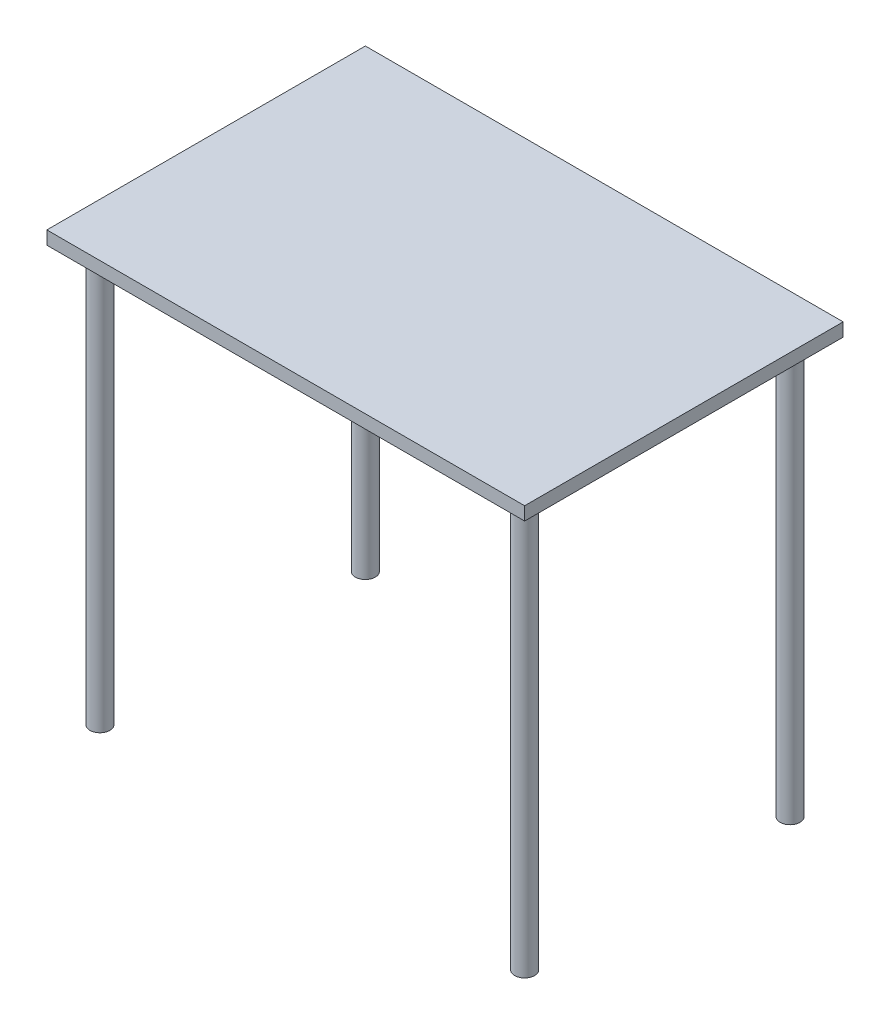
ISO-10303-21;
HEADER;
FILE_DESCRIPTION(('STEP AP214'),'2;1');
FILE_NAME('part.step','',(''),(''),'','','');
FILE_SCHEMA(('AUTOMOTIVE_DESIGN { 1 0 10303 214 1 1 1 1 }'));
ENDSEC;
DATA;
#1=APPLICATION_CONTEXT('core data for automotive mechanical design processes');
#2=APPLICATION_PROTOCOL_DEFINITION('international standard','automotive_design',2000,#1);
#3=PRODUCT_CONTEXT('',#1,'mechanical');
#4=PRODUCT('Part','Part','',(#3));
#5=PRODUCT_RELATED_PRODUCT_CATEGORY('part','',(#4));
#6=PRODUCT_DEFINITION_FORMATION('','',#4);
#7=PRODUCT_DEFINITION_CONTEXT('part definition',#1,'design');
#8=PRODUCT_DEFINITION('design','',#6,#7);
#9=PRODUCT_DEFINITION_SHAPE('','',#8);
#10=(LENGTH_UNIT() NAMED_UNIT(*) SI_UNIT(.MILLI.,.METRE.));
#11=(NAMED_UNIT(*) PLANE_ANGLE_UNIT() SI_UNIT($,.RADIAN.));
#12=(NAMED_UNIT(*) SI_UNIT($,.STERADIAN.) SOLID_ANGLE_UNIT());
#13=UNCERTAINTY_MEASURE_WITH_UNIT(LENGTH_MEASURE(1.E-05),#10,'distance_accuracy_value','');
#14=(GEOMETRIC_REPRESENTATION_CONTEXT(3) GLOBAL_UNCERTAINTY_ASSIGNED_CONTEXT((#13)) GLOBAL_UNIT_ASSIGNED_CONTEXT((#10,
#11,#12)) REPRESENTATION_CONTEXT('',''));
#15=CARTESIAN_POINT('',(0.,0.,0.));
#16=DIRECTION('',(0.,0.,1.));
#17=DIRECTION('',(1.,0.,0.));
#18=AXIS2_PLACEMENT_3D('',#15,#16,#17);
#19=CARTESIAN_POINT('',(0.,25.4,0.));
#20=DIRECTION('',(1.,0.,0.));
#21=DIRECTION('',(0.,0.,-1.));
#22=AXIS2_PLACEMENT_3D('',#19,#20,#21);
#23=PLANE('',#22);
#24=DIRECTION('',(0.,0.,1.));
#25=VECTOR('',#24,1.);
#26=CARTESIAN_POINT('',(0.,0.,0.));
#27=LINE('',#26,#25);
#28=CARTESIAN_POINT('',(0.,0.,-609.6));
#29=VERTEX_POINT('',#28);
#30=CARTESIAN_POINT('',(0.,0.,0.));
#31=VERTEX_POINT('',#30);
#32=EDGE_CURVE('E98',#29,#31,#27,.T.);
#33=ORIENTED_EDGE('',*,*,#32,.T.);
#34=DIRECTION('',(0.,-1.,0.));
#35=VECTOR('',#34,1.);
#36=CARTESIAN_POINT('',(0.,25.4,0.));
#37=LINE('',#36,#35);
#38=CARTESIAN_POINT('',(0.,25.4,0.));
#39=VERTEX_POINT('',#38);
#40=EDGE_CURVE('E12',#39,#31,#37,.T.);
#41=ORIENTED_EDGE('',*,*,#40,.F.);
#42=DIRECTION('',(0.,0.,1.));
#43=VECTOR('',#42,1.);
#44=CARTESIAN_POINT('',(0.,25.4,0.));
#45=LINE('',#44,#43);
#46=CARTESIAN_POINT('',(0.,25.4,-609.6));
#47=VERTEX_POINT('',#46);
#48=EDGE_CURVE('E86',#47,#39,#45,.T.);
#49=ORIENTED_EDGE('',*,*,#48,.F.);
#50=DIRECTION('',(0.,-1.,0.));
#51=VECTOR('',#50,1.);
#52=CARTESIAN_POINT('',(0.,25.4,-609.6));
#53=LINE('',#52,#51);
#54=EDGE_CURVE('E94',#47,#29,#53,.T.);
#55=ORIENTED_EDGE('',*,*,#54,.T.);
#56=EDGE_LOOP('',(#33,#41,#49,#55));
#57=FACE_BOUND('',#56,.T.);
#58=ADVANCED_FACE('F35',(#57),#23,.F.);
#59=CARTESIAN_POINT('',(0.,25.4,0.));
#60=DIRECTION('',(0.,0.,-1.));
#61=DIRECTION('',(-1.,0.,0.));
#62=AXIS2_PLACEMENT_3D('',#59,#60,#61);
#63=PLANE('',#62);
#64=DIRECTION('',(1.,0.,0.));
#65=VECTOR('',#64,1.);
#66=CARTESIAN_POINT('',(0.,0.,0.));
#67=LINE('',#66,#65);
#68=CARTESIAN_POINT('',(914.4,0.,0.));
#69=VERTEX_POINT('',#68);
#70=EDGE_CURVE('E90',#31,#69,#67,.T.);
#71=ORIENTED_EDGE('',*,*,#70,.T.);
#72=DIRECTION('',(0.,-1.,0.));
#73=VECTOR('',#72,1.);
#74=CARTESIAN_POINT('',(914.4,25.4,0.));
#75=LINE('',#74,#73);
#76=CARTESIAN_POINT('',(914.4,25.4,0.));
#77=VERTEX_POINT('',#76);
#78=EDGE_CURVE('E43',#77,#69,#75,.T.);
#79=ORIENTED_EDGE('',*,*,#78,.F.);
#80=DIRECTION('',(1.,0.,0.));
#81=VECTOR('',#80,1.);
#82=CARTESIAN_POINT('',(0.,25.4,0.));
#83=LINE('',#82,#81);
#84=EDGE_CURVE('E81',#39,#77,#83,.T.);
#85=ORIENTED_EDGE('',*,*,#84,.F.);
#86=ORIENTED_EDGE('',*,*,#40,.T.);
#87=EDGE_LOOP('',(#71,#79,#85,#86));
#88=FACE_BOUND('',#87,.T.);
#89=ADVANCED_FACE('F89',(#88),#63,.F.);
#90=CARTESIAN_POINT('',(914.4,25.4,0.));
#91=DIRECTION('',(-1.,0.,0.));
#92=DIRECTION('',(0.,0.,1.));
#93=AXIS2_PLACEMENT_3D('',#90,#91,#92);
#94=PLANE('',#93);
#95=DIRECTION('',(0.,0.,-1.));
#96=VECTOR('',#95,1.);
#97=CARTESIAN_POINT('',(914.4,0.,0.));
#98=LINE('',#97,#96);
#99=CARTESIAN_POINT('',(914.4,0.,-609.6));
#100=VERTEX_POINT('',#99);
#101=EDGE_CURVE('E68',#69,#100,#98,.T.);
#102=ORIENTED_EDGE('',*,*,#101,.T.);
#103=DIRECTION('',(0.,-1.,0.));
#104=VECTOR('',#103,1.);
#105=CARTESIAN_POINT('',(914.4,25.4,-609.6));
#106=LINE('',#105,#104);
#107=CARTESIAN_POINT('',(914.4,25.4,-609.6));
#108=VERTEX_POINT('',#107);
#109=EDGE_CURVE('E91',#108,#100,#106,.T.);
#110=ORIENTED_EDGE('',*,*,#109,.F.);
#111=DIRECTION('',(0.,0.,-1.));
#112=VECTOR('',#111,1.);
#113=CARTESIAN_POINT('',(914.4,25.4,0.));
#114=LINE('',#113,#112);
#115=EDGE_CURVE('E84',#77,#108,#114,.T.);
#116=ORIENTED_EDGE('',*,*,#115,.F.);
#117=ORIENTED_EDGE('',*,*,#78,.T.);
#118=EDGE_LOOP('',(#102,#110,#116,#117));
#119=FACE_BOUND('',#118,.T.);
#120=ADVANCED_FACE('F92',(#119),#94,.F.);
#121=CARTESIAN_POINT('',(0.,25.4,-609.6));
#122=DIRECTION('',(0.,0.,1.));
#123=DIRECTION('',(1.,0.,0.));
#124=AXIS2_PLACEMENT_3D('',#121,#122,#123);
#125=PLANE('',#124);
#126=DIRECTION('',(-1.,0.,0.));
#127=VECTOR('',#126,1.);
#128=CARTESIAN_POINT('',(0.,0.,-609.6));
#129=LINE('',#128,#127);
#130=EDGE_CURVE('E74',#100,#29,#129,.T.);
#131=ORIENTED_EDGE('',*,*,#130,.T.);
#132=ORIENTED_EDGE('',*,*,#54,.F.);
#133=DIRECTION('',(-1.,0.,0.));
#134=VECTOR('',#133,1.);
#135=CARTESIAN_POINT('',(0.,25.4,-609.6));
#136=LINE('',#135,#134);
#137=EDGE_CURVE('E51',#108,#47,#136,.T.);
#138=ORIENTED_EDGE('',*,*,#137,.F.);
#139=ORIENTED_EDGE('',*,*,#109,.T.);
#140=EDGE_LOOP('',(#131,#132,#138,#139));
#141=FACE_BOUND('',#140,.T.);
#142=ADVANCED_FACE('F106',(#141),#125,.F.);
#143=CARTESIAN_POINT('',(0.,25.4,0.));
#144=DIRECTION('',(0.,-1.,0.));
#145=DIRECTION('',(0.,0.,-1.));
#146=AXIS2_PLACEMENT_3D('',#143,#144,#145);
#147=PLANE('',#146);
#148=ORIENTED_EDGE('',*,*,#48,.T.);
#149=ORIENTED_EDGE('',*,*,#84,.T.);
#150=ORIENTED_EDGE('',*,*,#115,.T.);
#151=ORIENTED_EDGE('',*,*,#137,.T.);
#152=EDGE_LOOP('',(#148,#149,#150,#151));
#153=FACE_BOUND('',#152,.T.);
#154=ADVANCED_FACE('F82',(#153),#147,.F.);
#155=CARTESIAN_POINT('',(0.,0.,0.));
#156=DIRECTION('',(0.,-1.,0.));
#157=DIRECTION('',(0.,0.,-1.));
#158=AXIS2_PLACEMENT_3D('',#155,#156,#157);
#159=PLANE('',#158);
#160=CARTESIAN_POINT('',(863.6,0.,-558.8));
#161=DIRECTION('',(0.,-1.,0.));
#162=DIRECTION('',(0.,0.,-1.));
#163=AXIS2_PLACEMENT_3D('',#160,#161,#162);
#164=CIRCLE('',#163,19.05);
#165=CARTESIAN_POINT('',(863.6,0.,-577.85));
#166=VERTEX_POINT('',#165);
#167=EDGE_CURVE('E132',#166,#166,#164,.T.);
#168=ORIENTED_EDGE('',*,*,#167,.F.);
#169=EDGE_LOOP('',(#168));
#170=FACE_BOUND('',#169,.T.);
#171=CARTESIAN_POINT('',(50.8000000000001,0.,-558.8));
#172=DIRECTION('',(0.,-1.,0.));
#173=DIRECTION('',(0.,0.,-1.));
#174=AXIS2_PLACEMENT_3D('',#171,#172,#173);
#175=CIRCLE('',#174,19.05);
#176=CARTESIAN_POINT('',(50.8000000000001,0.,-577.85));
#177=VERTEX_POINT('',#176);
#178=EDGE_CURVE('E126',#177,#177,#175,.T.);
#179=ORIENTED_EDGE('',*,*,#178,.F.);
#180=EDGE_LOOP('',(#179));
#181=FACE_BOUND('',#180,.T.);
#182=CARTESIAN_POINT('',(863.6,0.,-50.7999999999999));
#183=DIRECTION('',(0.,-1.,0.));
#184=DIRECTION('',(0.,0.,-1.));
#185=AXIS2_PLACEMENT_3D('',#182,#183,#184);
#186=CIRCLE('',#185,19.05);
#187=CARTESIAN_POINT('',(863.6,0.,-69.8499999999999));
#188=VERTEX_POINT('',#187);
#189=EDGE_CURVE('E120',#188,#188,#186,.T.);
#190=ORIENTED_EDGE('',*,*,#189,.F.);
#191=EDGE_LOOP('',(#190));
#192=FACE_BOUND('',#191,.T.);
#193=CARTESIAN_POINT('',(50.8,0.,-50.8));
#194=DIRECTION('',(0.,-1.,0.));
#195=DIRECTION('',(0.,0.,-1.));
#196=AXIS2_PLACEMENT_3D('',#193,#194,#195);
#197=CIRCLE('',#196,19.0500000000001);
#198=CARTESIAN_POINT('',(50.8,0.,-69.8500000000001));
#199=VERTEX_POINT('',#198);
#200=EDGE_CURVE('E114',#199,#199,#197,.T.);
#201=ORIENTED_EDGE('',*,*,#200,.F.);
#202=EDGE_LOOP('',(#201));
#203=FACE_BOUND('',#202,.T.);
#204=ORIENTED_EDGE('',*,*,#32,.F.);
#205=ORIENTED_EDGE('',*,*,#130,.F.);
#206=ORIENTED_EDGE('',*,*,#101,.F.);
#207=ORIENTED_EDGE('',*,*,#70,.F.);
#208=EDGE_LOOP('',(#204,#205,#206,#207));
#209=FACE_BOUND('',#208,.T.);
#210=ADVANCED_FACE('F109',(#170,#181,#192,#203,#209),#159,.T.);
#211=CARTESIAN_POINT('',(50.8,-1668.63153672642,-50.8));
#212=DIRECTION('',(0.,1.,0.));
#213=DIRECTION('',(0.,0.,1.));
#214=AXIS2_PLACEMENT_3D('',#211,#212,#213);
#215=CYLINDRICAL_SURFACE('',#214,19.0500000000001);
#216=ORIENTED_EDGE('',*,*,#200,.T.);
#217=EDGE_LOOP('',(#216));
#218=FACE_BOUND('',#217,.T.);
#219=CARTESIAN_POINT('',(50.8,-794.675,-50.8));
#220=DIRECTION('',(0.,-1.,0.));
#221=DIRECTION('',(0.,0.,-1.));
#222=AXIS2_PLACEMENT_3D('',#219,#220,#221);
#223=CIRCLE('',#222,19.0500000000001);
#224=CARTESIAN_POINT('',(50.8,-794.675,-69.8500000000001));
#225=VERTEX_POINT('',#224);
#226=EDGE_CURVE('E101',#225,#225,#223,.T.);
#227=ORIENTED_EDGE('',*,*,#226,.F.);
#228=EDGE_LOOP('',(#227));
#229=FACE_BOUND('',#228,.T.);
#230=ADVANCED_FACE('F141',(#218,#229),#215,.T.);
#231=CARTESIAN_POINT('',(0.,-794.675,0.));
#232=DIRECTION('',(0.,-1.,0.));
#233=DIRECTION('',(0.,0.,-1.));
#234=AXIS2_PLACEMENT_3D('',#231,#232,#233);
#235=PLANE('',#234);
#236=ORIENTED_EDGE('',*,*,#226,.T.);
#237=EDGE_LOOP('',(#236));
#238=FACE_BOUND('',#237,.T.);
#239=ADVANCED_FACE('F151',(#238),#235,.T.);
#240=CARTESIAN_POINT('',(863.6,-1668.63153672642,-50.7999999999999));
#241=DIRECTION('',(0.,1.,0.));
#242=DIRECTION('',(0.,0.,1.));
#243=AXIS2_PLACEMENT_3D('',#240,#241,#242);
#244=CYLINDRICAL_SURFACE('',#243,19.05);
#245=ORIENTED_EDGE('',*,*,#189,.T.);
#246=EDGE_LOOP('',(#245));
#247=FACE_BOUND('',#246,.T.);
#248=CARTESIAN_POINT('',(863.6,-794.675,-50.7999999999999));
#249=DIRECTION('',(0.,-1.,0.));
#250=DIRECTION('',(0.,0.,-1.));
#251=AXIS2_PLACEMENT_3D('',#248,#249,#250);
#252=CIRCLE('',#251,19.05);
#253=CARTESIAN_POINT('',(863.6,-794.675,-69.8499999999999));
#254=VERTEX_POINT('',#253);
#255=EDGE_CURVE('E117',#254,#254,#252,.T.);
#256=ORIENTED_EDGE('',*,*,#255,.F.);
#257=EDGE_LOOP('',(#256));
#258=FACE_BOUND('',#257,.T.);
#259=ADVANCED_FACE('F156',(#247,#258),#244,.T.);
#260=CARTESIAN_POINT('',(0.,-794.675,0.));
#261=DIRECTION('',(0.,-1.,0.));
#262=DIRECTION('',(0.,0.,-1.));
#263=AXIS2_PLACEMENT_3D('',#260,#261,#262);
#264=PLANE('',#263);
#265=ORIENTED_EDGE('',*,*,#255,.T.);
#266=EDGE_LOOP('',(#265));
#267=FACE_BOUND('',#266,.T.);
#268=ADVANCED_FACE('F161',(#267),#264,.T.);
#269=CARTESIAN_POINT('',(50.8000000000001,-1668.63153672642,-558.8));
#270=DIRECTION('',(0.,1.,0.));
#271=DIRECTION('',(0.,0.,1.));
#272=AXIS2_PLACEMENT_3D('',#269,#270,#271);
#273=CYLINDRICAL_SURFACE('',#272,19.05);
#274=ORIENTED_EDGE('',*,*,#178,.T.);
#275=EDGE_LOOP('',(#274));
#276=FACE_BOUND('',#275,.T.);
#277=CARTESIAN_POINT('',(50.8000000000001,-794.675,-558.8));
#278=DIRECTION('',(0.,-1.,0.));
#279=DIRECTION('',(0.,0.,-1.));
#280=AXIS2_PLACEMENT_3D('',#277,#278,#279);
#281=CIRCLE('',#280,19.05);
#282=CARTESIAN_POINT('',(50.8000000000001,-794.675,-577.85));
#283=VERTEX_POINT('',#282);
#284=EDGE_CURVE('E123',#283,#283,#281,.T.);
#285=ORIENTED_EDGE('',*,*,#284,.F.);
#286=EDGE_LOOP('',(#285));
#287=FACE_BOUND('',#286,.T.);
#288=ADVANCED_FACE('F207',(#276,#287),#273,.T.);
#289=CARTESIAN_POINT('',(0.,-794.675,0.));
#290=DIRECTION('',(0.,-1.,0.));
#291=DIRECTION('',(0.,0.,-1.));
#292=AXIS2_PLACEMENT_3D('',#289,#290,#291);
#293=PLANE('',#292);
#294=ORIENTED_EDGE('',*,*,#284,.T.);
#295=EDGE_LOOP('',(#294));
#296=FACE_BOUND('',#295,.T.);
#297=ADVANCED_FACE('F217',(#296),#293,.T.);
#298=CARTESIAN_POINT('',(863.6,-1668.63153672642,-558.8));
#299=DIRECTION('',(0.,1.,0.));
#300=DIRECTION('',(0.,0.,1.));
#301=AXIS2_PLACEMENT_3D('',#298,#299,#300);
#302=CYLINDRICAL_SURFACE('',#301,19.05);
#303=ORIENTED_EDGE('',*,*,#167,.T.);
#304=EDGE_LOOP('',(#303));
#305=FACE_BOUND('',#304,.T.);
#306=CARTESIAN_POINT('',(863.6,-794.675,-558.8));
#307=DIRECTION('',(0.,-1.,0.));
#308=DIRECTION('',(0.,0.,-1.));
#309=AXIS2_PLACEMENT_3D('',#306,#307,#308);
#310=CIRCLE('',#309,19.05);
#311=CARTESIAN_POINT('',(863.6,-794.675,-577.85));
#312=VERTEX_POINT('',#311);
#313=EDGE_CURVE('E129',#312,#312,#310,.T.);
#314=ORIENTED_EDGE('',*,*,#313,.F.);
#315=EDGE_LOOP('',(#314));
#316=FACE_BOUND('',#315,.T.);
#317=ADVANCED_FACE('F136',(#305,#316),#302,.T.);
#318=CARTESIAN_POINT('',(0.,-794.675,0.));
#319=DIRECTION('',(0.,-1.,0.));
#320=DIRECTION('',(0.,0.,-1.));
#321=AXIS2_PLACEMENT_3D('',#318,#319,#320);
#322=PLANE('',#321);
#323=ORIENTED_EDGE('',*,*,#313,.T.);
#324=EDGE_LOOP('',(#323));
#325=FACE_BOUND('',#324,.T.);
#326=ADVANCED_FACE('F236',(#325),#322,.T.);
#327=CLOSED_SHELL('',(#58,#89,#120,#142,#154,#210,#230,#239,#259,#268,#288,#297,#317,#326));
#328=MANIFOLD_SOLID_BREP('B2',#327);
#329=ADVANCED_BREP_SHAPE_REPRESENTATION('',(#18,#328),#14);
#330=SHAPE_DEFINITION_REPRESENTATION(#9,#329);
ENDSEC;
END-ISO-10303-21;
